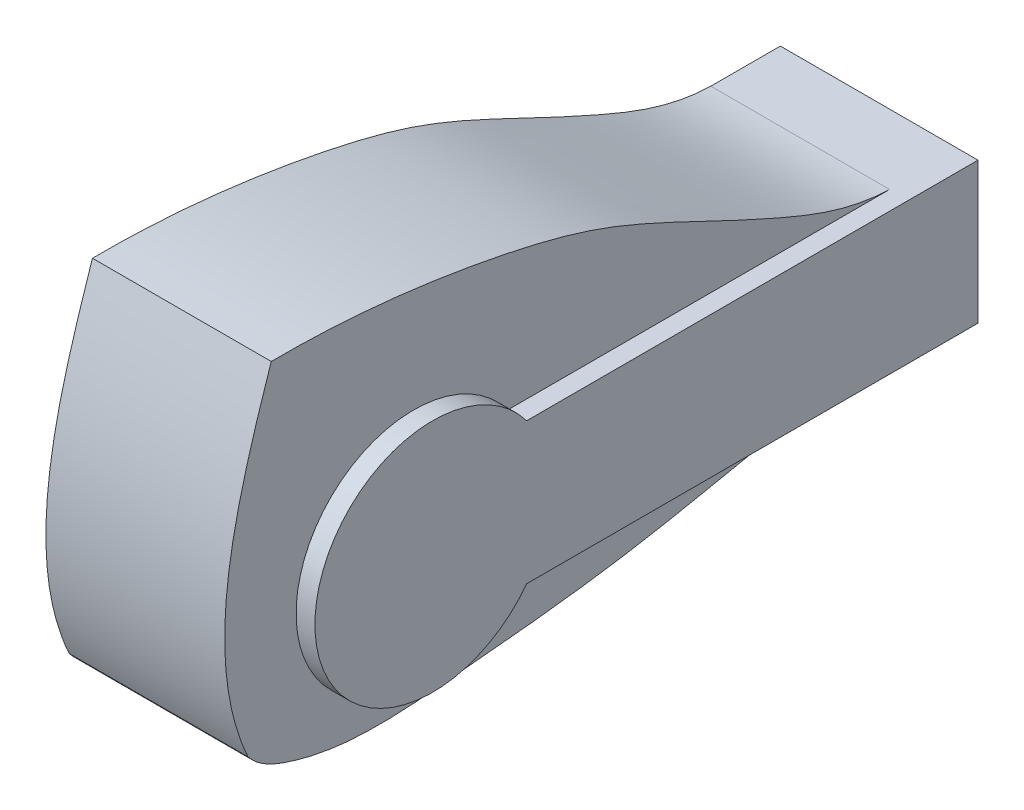
ISO-10303-21;
HEADER;
FILE_DESCRIPTION(('STEP AP214'),'2;1');
FILE_NAME('part.step','',(''),(''),'','','');
FILE_SCHEMA(('AUTOMOTIVE_DESIGN { 1 0 10303 214 1 1 1 1 }'));
ENDSEC;
DATA;
#1=APPLICATION_CONTEXT('core data for automotive mechanical design processes');
#2=APPLICATION_PROTOCOL_DEFINITION('international standard','automotive_design',2000,#1);
#3=PRODUCT_CONTEXT('',#1,'mechanical');
#4=PRODUCT('Part','Part','',(#3));
#5=PRODUCT_RELATED_PRODUCT_CATEGORY('part','',(#4));
#6=PRODUCT_DEFINITION_FORMATION('','',#4);
#7=PRODUCT_DEFINITION_CONTEXT('part definition',#1,'design');
#8=PRODUCT_DEFINITION('design','',#6,#7);
#9=PRODUCT_DEFINITION_SHAPE('','',#8);
#10=(LENGTH_UNIT() NAMED_UNIT(*) SI_UNIT(.MILLI.,.METRE.));
#11=(NAMED_UNIT(*) PLANE_ANGLE_UNIT() SI_UNIT($,.RADIAN.));
#12=(NAMED_UNIT(*) SI_UNIT($,.STERADIAN.) SOLID_ANGLE_UNIT());
#13=UNCERTAINTY_MEASURE_WITH_UNIT(LENGTH_MEASURE(1.E-05),#10,'distance_accuracy_value','');
#14=(GEOMETRIC_REPRESENTATION_CONTEXT(3) GLOBAL_UNCERTAINTY_ASSIGNED_CONTEXT((#13)) GLOBAL_UNIT_ASSIGNED_CONTEXT((#10,
#11,#12)) REPRESENTATION_CONTEXT('',''));
#15=CARTESIAN_POINT('',(0.,0.,0.));
#16=DIRECTION('',(0.,0.,1.));
#17=DIRECTION('',(1.,0.,0.));
#18=AXIS2_PLACEMENT_3D('',#15,#16,#17);
#19=CARTESIAN_POINT('',(19.,39.2900985956095,-37.3449264717519));
#20=DIRECTION('',(1.,0.,0.));
#21=DIRECTION('',(0.,0.,-1.));
#22=AXIS2_PLACEMENT_3D('',#19,#20,#21);
#23=PLANE('',#22);
#24=CARTESIAN_POINT('',(19.,0.,0.));
#25=DIRECTION('',(1.,0.,0.));
#26=DIRECTION('',(0.,0.,-1.));
#27=AXIS2_PLACEMENT_3D('',#24,#25,#26);
#28=CIRCLE('',#27,25.);
#29=CARTESIAN_POINT('',(19.,15.,-20.));
#30=VERTEX_POINT('',#29);
#31=CARTESIAN_POINT('',(19.,-15.,-20.));
#32=VERTEX_POINT('',#31);
#33=EDGE_CURVE('E140',#30,#32,#28,.T.);
#34=ORIENTED_EDGE('',*,*,#33,.F.);
#35=DIRECTION('',(0.,0.,1.));
#36=VECTOR('',#35,1.);
#37=CARTESIAN_POINT('',(19.,15.,-115.903665145385));
#38=LINE('',#37,#36);
#39=CARTESIAN_POINT('',(19.,15.,-101.125836247495));
#40=VERTEX_POINT('',#39);
#41=EDGE_CURVE('E131',#40,#30,#38,.T.);
#42=ORIENTED_EDGE('',*,*,#41,.F.);
#43=CARTESIAN_POINT('',(19.,15.,-101.125836247495));
#44=CARTESIAN_POINT('',(19.,15.2371023249501,-93.0556435679497));
#45=CARTESIAN_POINT('',(19.,20.1299508776821,-80.2161482893432));
#46=CARTESIAN_POINT('',(19.,29.5403377789544,-60.084206576604));
#47=CARTESIAN_POINT('',(19.,39.089257370898,-40.5997845557344));
#48=CARTESIAN_POINT('',(19.,46.5993775787798,-9.28663344845154));
#49=CARTESIAN_POINT('',(19.,49.1680849419061,14.0329866438163));
#50=CARTESIAN_POINT('',(19.,49.0428216526482,30.2788214922476));
#51=B_SPLINE_CURVE_WITH_KNOTS('',3,(#43,#44,#45,#46,#47,#48,#49,#50),.UNSPECIFIED.,.F.,.F.,(4,1,
1,1,1,4),(0.,0.173071545712068,0.298474425957831,0.487248587932276,0.645643018137249,1.),.UNSPECIFIED.);
#52=CARTESIAN_POINT('',(19.,49.0428216526482,30.2788214922476));
#53=VERTEX_POINT('',#52);
#54=EDGE_CURVE('E146',#40,#53,#51,.T.);
#55=ORIENTED_EDGE('',*,*,#54,.T.);
#56=CARTESIAN_POINT('',(19.,49.0428216526482,30.2788214922476));
#57=CARTESIAN_POINT('',(19.,26.8832590089713,37.7125181780811));
#58=CARTESIAN_POINT('',(19.,1.57392442737834,45.5014089192038));
#59=CARTESIAN_POINT('',(19.,-21.2287194528074,35.2285259952465));
#60=B_SPLINE_CURVE_WITH_KNOTS('',3,(#56,#57,#58,#59),.UNSPECIFIED.,.F.,.F.,(4,4),(0.,1.),.UNSPECIFIED.);
#61=CARTESIAN_POINT('',(19.,-21.2287194528074,35.2285259952465));
#62=VERTEX_POINT('',#61);
#63=EDGE_CURVE('E153',#53,#62,#60,.T.);
#64=ORIENTED_EDGE('',*,*,#63,.T.);
#65=CARTESIAN_POINT('',(19.,-21.2287194528074,35.2285259952465));
#66=CARTESIAN_POINT('',(19.,-24.0711177895143,33.006450864699));
#67=CARTESIAN_POINT('',(19.,-26.8634124263914,26.4975327296185));
#68=CARTESIAN_POINT('',(19.,-30.1292346040286,11.3352777973743));
#69=CARTESIAN_POINT('',(19.,-27.9297198057202,-12.7190649791264));
#70=CARTESIAN_POINT('',(19.,-25.0575647715951,-43.0966837619855));
#71=CARTESIAN_POINT('',(19.,-18.431064090082,-73.3870517377117));
#72=CARTESIAN_POINT('',(19.,-14.8671501530497,-92.12686665555));
#73=CARTESIAN_POINT('',(19.,-15.,-101.125836247495));
#74=B_SPLINE_CURVE_WITH_KNOTS('',3,(#65,#66,#67,#68,#69,#70,#71,#72,#73),.UNSPECIFIED.,.F.,.F.,
(4,1,1,1,1,1,4),(0.,0.0752074129222468,0.148741353481903,0.333288021629,0.588928464409261,
0.808106250047639,1.),.UNSPECIFIED.);
#75=CARTESIAN_POINT('',(19.,-15.,-99.0853328797834));
#76=VERTEX_POINT('',#75);
#77=EDGE_CURVE('E161',#62,#76,#74,.T.);
#78=ORIENTED_EDGE('',*,*,#77,.T.);
#79=DIRECTION('',(0.,0.,-1.));
#80=VECTOR('',#79,1.);
#81=CARTESIAN_POINT('',(19.,-15.,-115.903665145385));
#82=LINE('',#81,#80);
#83=EDGE_CURVE('E123',#32,#76,#82,.T.);
#84=ORIENTED_EDGE('',*,*,#83,.F.);
#85=EDGE_LOOP('',(#34,#42,#55,#64,#78,#84));
#86=FACE_BOUND('',#85,.T.);
#87=ADVANCED_FACE('F33',(#86),#23,.T.);
#88=CARTESIAN_POINT('',(23.,0.,0.));
#89=DIRECTION('',(-1.,0.,0.));
#90=DIRECTION('',(0.,0.,1.));
#91=AXIS2_PLACEMENT_3D('',#88,#89,#90);
#92=CYLINDRICAL_SURFACE('',#91,25.);
#93=DIRECTION('',(-1.,0.,0.));
#94=VECTOR('',#93,1.);
#95=CARTESIAN_POINT('',(23.,15.,-20.));
#96=LINE('',#95,#94);
#97=CARTESIAN_POINT('',(23.,15.,-20.));
#98=VERTEX_POINT('',#97);
#99=EDGE_CURVE('E117',#30,#98,#96,.F.);
#100=ORIENTED_EDGE('',*,*,#99,.F.);
#101=ORIENTED_EDGE('',*,*,#33,.T.);
#102=DIRECTION('',(-1.,0.,0.));
#103=VECTOR('',#102,1.);
#104=CARTESIAN_POINT('',(23.,-15.,-20.));
#105=LINE('',#104,#103);
#106=CARTESIAN_POINT('',(23.,-15.,-20.));
#107=VERTEX_POINT('',#106);
#108=EDGE_CURVE('E130',#107,#32,#105,.T.);
#109=ORIENTED_EDGE('',*,*,#108,.F.);
#110=CARTESIAN_POINT('',(23.,0.,0.));
#111=DIRECTION('',(1.,0.,0.));
#112=DIRECTION('',(0.,0.,-1.));
#113=AXIS2_PLACEMENT_3D('',#110,#111,#112);
#114=CIRCLE('',#113,25.);
#115=EDGE_CURVE('E141',#98,#107,#114,.T.);
#116=ORIENTED_EDGE('',*,*,#115,.F.);
#117=EDGE_LOOP('',(#100,#101,#109,#116));
#118=FACE_BOUND('',#117,.T.);
#119=ADVANCED_FACE('F215',(#118),#92,.T.);
#120=CARTESIAN_POINT('',(-19.,15.,-101.125836247495));
#121=CARTESIAN_POINT('',(-19.,15.2371023249501,-93.0556435679497));
#122=CARTESIAN_POINT('',(-19.,20.1299508776821,-80.2161482893432));
#123=CARTESIAN_POINT('',(-19.,29.5403377789544,-60.084206576604));
#124=CARTESIAN_POINT('',(-19.,39.089257370898,-40.5997845557344));
#125=CARTESIAN_POINT('',(-19.,46.5993775787798,-9.28663344845154));
#126=CARTESIAN_POINT('',(-19.,49.1680849419061,14.0329866438163));
#127=CARTESIAN_POINT('',(-19.,49.0428216526482,30.2788214922476));
#128=B_SPLINE_CURVE_WITH_KNOTS('',3,(#120,#121,#122,#123,#124,#125,#126,#127),.UNSPECIFIED.,.F.,
.F.,(4,1,1,1,1,4),(0.,0.173071545712068,0.298474425957831,0.487248587932276,0.645643018137249,
1.),.UNSPECIFIED.);
#129=DIRECTION('',(1.,0.,0.));
#130=VECTOR('',#129,1.);
#131=SURFACE_OF_LINEAR_EXTRUSION('',#128,#130);
#132=DIRECTION('',(1.,0.,0.));
#133=VECTOR('',#132,1.);
#134=CARTESIAN_POINT('',(-19.,49.0428216526482,30.2788214922476));
#135=LINE('',#134,#133);
#136=CARTESIAN_POINT('',(-19.,49.0428216526482,30.2788214922476));
#137=VERTEX_POINT('',#136);
#138=EDGE_CURVE('E38',#137,#53,#135,.T.);
#139=ORIENTED_EDGE('',*,*,#138,.T.);
#140=ORIENTED_EDGE('',*,*,#54,.F.);
#141=DIRECTION('',(1.,0.,0.));
#142=VECTOR('',#141,1.);
#143=CARTESIAN_POINT('',(-19.,15.,-101.125836247495));
#144=LINE('',#143,#142);
#145=CARTESIAN_POINT('',(-19.,15.,-101.125836247495));
#146=VERTEX_POINT('',#145);
#147=EDGE_CURVE('E11',#146,#40,#144,.T.);
#148=ORIENTED_EDGE('',*,*,#147,.F.);
#149=EDGE_CURVE('E168',#146,#137,#128,.T.);
#150=ORIENTED_EDGE('',*,*,#149,.T.);
#151=EDGE_LOOP('',(#139,#140,#148,#150));
#152=FACE_BOUND('',#151,.T.);
#153=ADVANCED_FACE('F35',(#152),#131,.T.);
#154=CARTESIAN_POINT('',(-19.,15.,-101.125836247495));
#155=DIRECTION('',(0.,1.,0.));
#156=DIRECTION('',(0.,0.,1.));
#157=AXIS2_PLACEMENT_3D('',#154,#155,#156);
#158=PLANE('',#157);
#159=ORIENTED_EDGE('',*,*,#147,.T.);
#160=ORIENTED_EDGE('',*,*,#41,.T.);
#161=ORIENTED_EDGE('',*,*,#99,.T.);
#162=DIRECTION('',(0.,0.,1.));
#163=VECTOR('',#162,1.);
#164=CARTESIAN_POINT('',(23.,15.,-115.903665145385));
#165=LINE('',#164,#163);
#166=CARTESIAN_POINT('',(23.,15.,-115.903665145385));
#167=VERTEX_POINT('',#166);
#168=EDGE_CURVE('E51',#167,#98,#165,.T.);
#169=ORIENTED_EDGE('',*,*,#168,.F.);
#170=DIRECTION('',(1.,0.,0.));
#171=VECTOR('',#170,1.);
#172=CARTESIAN_POINT('',(-19.,15.,-115.903665145385));
#173=LINE('',#172,#171);
#174=CARTESIAN_POINT('',(-19.,15.,-115.903665145385));
#175=VERTEX_POINT('',#174);
#176=EDGE_CURVE('E43',#175,#167,#173,.T.);
#177=ORIENTED_EDGE('',*,*,#176,.F.);
#178=DIRECTION('',(0.,0.,1.));
#179=VECTOR('',#178,1.);
#180=CARTESIAN_POINT('',(-19.,15.,-101.125836247495));
#181=LINE('',#180,#179);
#182=EDGE_CURVE('E240',#175,#146,#181,.T.);
#183=ORIENTED_EDGE('',*,*,#182,.T.);
#184=EDGE_LOOP('',(#159,#160,#161,#169,#177,#183));
#185=FACE_BOUND('',#184,.T.);
#186=ADVANCED_FACE('F115',(#185),#158,.T.);
#187=CARTESIAN_POINT('',(-19.,15.,-115.903665145385));
#188=DIRECTION('',(0.,0.,-1.));
#189=DIRECTION('',(-1.,0.,0.));
#190=AXIS2_PLACEMENT_3D('',#187,#188,#189);
#191=PLANE('',#190);
#192=ORIENTED_EDGE('',*,*,#176,.T.);
#193=DIRECTION('',(0.,1.,0.));
#194=VECTOR('',#193,1.);
#195=CARTESIAN_POINT('',(23.,15.,-115.903665145385));
#196=LINE('',#195,#194);
#197=CARTESIAN_POINT('',(23.,-15.,-115.903665145385));
#198=VERTEX_POINT('',#197);
#199=EDGE_CURVE('E107',#198,#167,#196,.T.);
#200=ORIENTED_EDGE('',*,*,#199,.F.);
#201=DIRECTION('',(1.,0.,0.));
#202=VECTOR('',#201,1.);
#203=CARTESIAN_POINT('',(-19.,-15.,-115.903665145385));
#204=LINE('',#203,#202);
#205=CARTESIAN_POINT('',(-19.,-15.,-115.903665145385));
#206=VERTEX_POINT('',#205);
#207=EDGE_CURVE('E113',#206,#198,#204,.T.);
#208=ORIENTED_EDGE('',*,*,#207,.F.);
#209=DIRECTION('',(0.,1.,0.));
#210=VECTOR('',#209,1.);
#211=CARTESIAN_POINT('',(-19.,15.,-115.903665145385));
#212=LINE('',#211,#210);
#213=EDGE_CURVE('E109',#206,#175,#212,.T.);
#214=ORIENTED_EDGE('',*,*,#213,.T.);
#215=EDGE_LOOP('',(#192,#200,#208,#214));
#216=FACE_BOUND('',#215,.T.);
#217=ADVANCED_FACE('F106',(#216),#191,.T.);
#218=CARTESIAN_POINT('',(-19.,-15.,-115.903665145385));
#219=DIRECTION('',(0.,-1.,0.));
#220=DIRECTION('',(0.,0.,-1.));
#221=AXIS2_PLACEMENT_3D('',#218,#219,#220);
#222=PLANE('',#221);
#223=ORIENTED_EDGE('',*,*,#207,.T.);
#224=DIRECTION('',(0.,0.,-1.));
#225=VECTOR('',#224,1.);
#226=CARTESIAN_POINT('',(23.,-15.,-115.903665145385));
#227=LINE('',#226,#225);
#228=EDGE_CURVE('E119',#107,#198,#227,.T.);
#229=ORIENTED_EDGE('',*,*,#228,.F.);
#230=ORIENTED_EDGE('',*,*,#108,.T.);
#231=ORIENTED_EDGE('',*,*,#83,.T.);
#232=CARTESIAN_POINT('',(19.,-15.,-101.125836247495));
#233=VERTEX_POINT('',#232);
#234=EDGE_CURVE('E126',#76,#233,#82,.T.);
#235=ORIENTED_EDGE('',*,*,#234,.T.);
#236=DIRECTION('',(1.,0.,0.));
#237=VECTOR('',#236,1.);
#238=CARTESIAN_POINT('',(-19.,-15.,-101.125836247495));
#239=LINE('',#238,#237);
#240=CARTESIAN_POINT('',(-19.,-15.,-101.125836247495));
#241=VERTEX_POINT('',#240);
#242=EDGE_CURVE('E234',#241,#233,#239,.T.);
#243=ORIENTED_EDGE('',*,*,#242,.F.);
#244=DIRECTION('',(0.,0.,-1.));
#245=VECTOR('',#244,1.);
#246=CARTESIAN_POINT('',(-19.,-15.,-115.903665145385));
#247=LINE('',#246,#245);
#248=EDGE_CURVE('E244',#241,#206,#247,.T.);
#249=ORIENTED_EDGE('',*,*,#248,.T.);
#250=EDGE_LOOP('',(#223,#229,#230,#231,#235,#243,#249));
#251=FACE_BOUND('',#250,.T.);
#252=ADVANCED_FACE('F201',(#251),#222,.T.);
#253=CARTESIAN_POINT('',(-19.,-21.2287194528074,35.2285259952465));
#254=CARTESIAN_POINT('',(-19.,-24.0711177895143,33.006450864699));
#255=CARTESIAN_POINT('',(-19.,-26.8634124263914,26.4975327296185));
#256=CARTESIAN_POINT('',(-19.,-30.1292346040286,11.3352777973743));
#257=CARTESIAN_POINT('',(-19.,-27.9297198057202,-12.7190649791264));
#258=CARTESIAN_POINT('',(-19.,-25.0575647715951,-43.0966837619855));
#259=CARTESIAN_POINT('',(-19.,-18.431064090082,-73.3870517377117));
#260=CARTESIAN_POINT('',(-19.,-14.8671501530497,-92.12686665555));
#261=CARTESIAN_POINT('',(-19.,-15.,-101.125836247495));
#262=B_SPLINE_CURVE_WITH_KNOTS('',3,(#253,#254,#255,#256,#257,#258,#259,#260,#261),
.UNSPECIFIED.,.F.,.F.,(4,1,1,1,1,1,4),(0.,0.0752074129222468,0.148741353481903,0.333288021629,
0.588928464409261,0.808106250047639,1.),.UNSPECIFIED.);
#263=DIRECTION('',(1.,0.,0.));
#264=VECTOR('',#263,1.);
#265=SURFACE_OF_LINEAR_EXTRUSION('',#262,#264);
#266=ORIENTED_EDGE('',*,*,#242,.T.);
#267=CARTESIAN_POINT('',(19.,-21.2287194528074,35.2285259952465));
#268=CARTESIAN_POINT('',(19.,-24.0711177895143,33.006450864699));
#269=CARTESIAN_POINT('',(19.,-26.8634124263914,26.4975327296185));
#270=CARTESIAN_POINT('',(19.,-30.1292346040286,11.3352777973743));
#271=CARTESIAN_POINT('',(19.,-27.9297198057202,-12.7190649791264));
#272=CARTESIAN_POINT('',(19.,-25.0575647715951,-43.0966837619855));
#273=CARTESIAN_POINT('',(19.,-18.431064090082,-73.3870517377117));
#274=CARTESIAN_POINT('',(19.,-14.8671501530497,-92.12686665555));
#275=CARTESIAN_POINT('',(19.,-15.,-101.125836247495));
#276=B_SPLINE_CURVE_WITH_KNOTS('',3,(#267,#268,#269,#270,#271,#272,#273,#274,#275),
.UNSPECIFIED.,.F.,.F.,(4,1,1,1,1,1,4),(0.,0.0752074129222468,0.148741353481903,0.333288021629,
0.588928464409261,0.808106250047639,1.),.UNSPECIFIED.);
#277=EDGE_CURVE('E136',#76,#233,#276,.T.);
#278=ORIENTED_EDGE('',*,*,#277,.F.);
#279=ORIENTED_EDGE('',*,*,#77,.F.);
#280=DIRECTION('',(1.,0.,0.));
#281=VECTOR('',#280,1.);
#282=CARTESIAN_POINT('',(-19.,-21.2287194528074,35.2285259952465));
#283=LINE('',#282,#281);
#284=CARTESIAN_POINT('',(-19.,-21.2287194528074,35.2285259952465));
#285=VERTEX_POINT('',#284);
#286=EDGE_CURVE('E237',#285,#62,#283,.T.);
#287=ORIENTED_EDGE('',*,*,#286,.F.);
#288=EDGE_CURVE('E185',#285,#241,#262,.T.);
#289=ORIENTED_EDGE('',*,*,#288,.T.);
#290=EDGE_LOOP('',(#266,#278,#279,#287,#289));
#291=FACE_BOUND('',#290,.T.);
#292=ADVANCED_FACE('F197',(#291),#265,.T.);
#293=CARTESIAN_POINT('',(-19.,49.0428216526482,30.2788214922476));
#294=CARTESIAN_POINT('',(-19.,26.8832590089713,37.7125181780811));
#295=CARTESIAN_POINT('',(-19.,1.57392442737834,45.5014089192038));
#296=CARTESIAN_POINT('',(-19.,-21.2287194528074,35.2285259952465));
#297=B_SPLINE_CURVE_WITH_KNOTS('',3,(#293,#294,#295,#296),.UNSPECIFIED.,.F.,.F.,(4,4),(0.,1.),.UNSPECIFIED.);
#298=DIRECTION('',(1.,0.,0.));
#299=VECTOR('',#298,1.);
#300=SURFACE_OF_LINEAR_EXTRUSION('',#297,#299);
#301=ORIENTED_EDGE('',*,*,#286,.T.);
#302=ORIENTED_EDGE('',*,*,#63,.F.);
#303=ORIENTED_EDGE('',*,*,#138,.F.);
#304=EDGE_CURVE('E176',#137,#285,#297,.T.);
#305=ORIENTED_EDGE('',*,*,#304,.T.);
#306=EDGE_LOOP('',(#301,#302,#303,#305));
#307=FACE_BOUND('',#306,.T.);
#308=ADVANCED_FACE('F193',(#307),#300,.T.);
#309=CARTESIAN_POINT('',(-19.,39.2900985956095,-37.3449264717519));
#310=DIRECTION('',(1.,0.,0.));
#311=DIRECTION('',(0.,0.,-1.));
#312=AXIS2_PLACEMENT_3D('',#309,#310,#311);
#313=PLANE('',#312);
#314=ORIENTED_EDGE('',*,*,#149,.F.);
#315=ORIENTED_EDGE('',*,*,#182,.F.);
#316=ORIENTED_EDGE('',*,*,#213,.F.);
#317=ORIENTED_EDGE('',*,*,#248,.F.);
#318=ORIENTED_EDGE('',*,*,#288,.F.);
#319=ORIENTED_EDGE('',*,*,#304,.F.);
#320=EDGE_LOOP('',(#314,#315,#316,#317,#318,#319));
#321=FACE_BOUND('',#320,.T.);
#322=ADVANCED_FACE('F196',(#321),#313,.F.);
#323=CARTESIAN_POINT('',(23.,0.,0.));
#324=DIRECTION('',(1.,0.,0.));
#325=DIRECTION('',(0.,0.,-1.));
#326=AXIS2_PLACEMENT_3D('',#323,#324,#325);
#327=PLANE('',#326);
#328=ORIENTED_EDGE('',*,*,#115,.T.);
#329=ORIENTED_EDGE('',*,*,#228,.T.);
#330=ORIENTED_EDGE('',*,*,#199,.T.);
#331=ORIENTED_EDGE('',*,*,#168,.T.);
#332=EDGE_LOOP('',(#328,#329,#330,#331));
#333=FACE_BOUND('',#332,.T.);
#334=ADVANCED_FACE('F122',(#333),#327,.T.);
#335=CARTESIAN_POINT('',(19.,0.,0.));
#336=DIRECTION('',(-1.,0.,0.));
#337=DIRECTION('',(0.,0.,1.));
#338=AXIS2_PLACEMENT_3D('',#335,#336,#337);
#339=PLANE('',#338);
#340=ORIENTED_EDGE('',*,*,#234,.F.);
#341=ORIENTED_EDGE('',*,*,#277,.T.);
#342=EDGE_LOOP('',(#340,#341));
#343=FACE_BOUND('',#342,.T.);
#344=ADVANCED_FACE('F222',(#343),#339,.T.);
#345=CLOSED_SHELL('',(#87,#119,#153,#186,#217,#252,#292,#308,#322,#334,#344));
#346=MANIFOLD_SOLID_BREP('B2',#345);
#347=ADVANCED_BREP_SHAPE_REPRESENTATION('',(#18,#346),#14);
#348=SHAPE_DEFINITION_REPRESENTATION(#9,#347);
ENDSEC;
END-ISO-10303-21;
